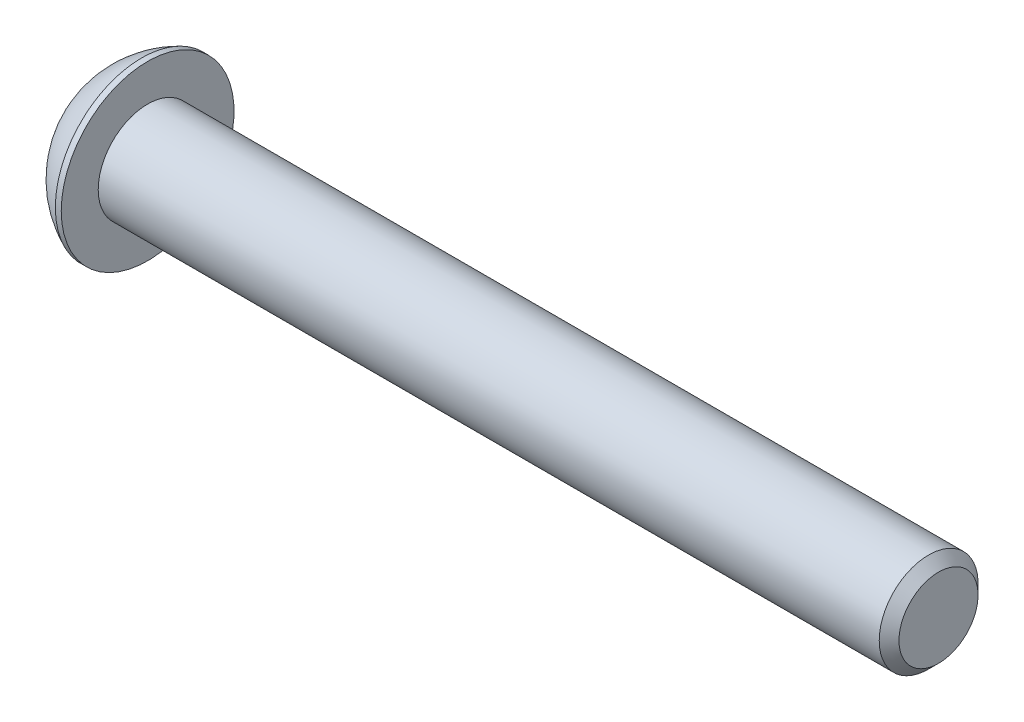
ISO-10303-21;
HEADER;
FILE_DESCRIPTION(('STEP AP214'),'2;1');
FILE_NAME('part.step','',(''),(''),'','','');
FILE_SCHEMA(('AUTOMOTIVE_DESIGN { 1 0 10303 214 1 1 1 1 }'));
ENDSEC;
DATA;
#1=APPLICATION_CONTEXT('core data for automotive mechanical design processes');
#2=APPLICATION_PROTOCOL_DEFINITION('international standard','automotive_design',2000,#1);
#3=PRODUCT_CONTEXT('',#1,'mechanical');
#4=PRODUCT('Part','Part','',(#3));
#5=PRODUCT_RELATED_PRODUCT_CATEGORY('part','',(#4));
#6=PRODUCT_DEFINITION_FORMATION('','',#4);
#7=PRODUCT_DEFINITION_CONTEXT('part definition',#1,'design');
#8=PRODUCT_DEFINITION('design','',#6,#7);
#9=PRODUCT_DEFINITION_SHAPE('','',#8);
#10=(LENGTH_UNIT() NAMED_UNIT(*) SI_UNIT(.MILLI.,.METRE.));
#11=(NAMED_UNIT(*) PLANE_ANGLE_UNIT() SI_UNIT($,.RADIAN.));
#12=(NAMED_UNIT(*) SI_UNIT($,.STERADIAN.) SOLID_ANGLE_UNIT());
#13=UNCERTAINTY_MEASURE_WITH_UNIT(LENGTH_MEASURE(1.E-05),#10,'distance_accuracy_value','');
#14=(GEOMETRIC_REPRESENTATION_CONTEXT(3) GLOBAL_UNCERTAINTY_ASSIGNED_CONTEXT((#13)) GLOBAL_UNIT_ASSIGNED_CONTEXT((#10,
#11,#12)) REPRESENTATION_CONTEXT('',''));
#15=CARTESIAN_POINT('',(0.,0.,0.));
#16=DIRECTION('',(0.,0.,1.));
#17=DIRECTION('',(1.,0.,0.));
#18=AXIS2_PLACEMENT_3D('',#15,#16,#17);
#19=CARTESIAN_POINT('',(1.32080000000034,0.,0.));
#20=DIRECTION('',(-1.,0.,0.));
#21=DIRECTION('',(0.,0.,1.));
#22=AXIS2_PLACEMENT_3D('',#19,#20,#21);
#23=CONICAL_SURFACE('',#22,1.1937999999998,1.04719755119608);
#24=CARTESIAN_POINT('',(2.01004075135902,0.,-4.44089209850063E-13));
#25=VERTEX_POINT('',#24);
#26=VERTEX_LOOP('',#25);
#27=FACE_BOUND('',#26,.T.);
#28=CARTESIAN_POINT('',(1.32080000000009,0.,0.));
#29=DIRECTION('',(-1.,0.,0.));
#30=DIRECTION('',(0.,0.,1.));
#31=AXIS2_PLACEMENT_3D('',#28,#29,#30);
#32=CIRCLE('',#31,1.19380000000024);
#33=CARTESIAN_POINT('',(1.32080000000009,0.,1.19380000000024));
#34=VERTEX_POINT('',#33);
#35=EDGE_CURVE('E20',#34,#34,#32,.T.);
#36=ORIENTED_EDGE('',*,*,#35,.T.);
#37=EDGE_LOOP('',(#36));
#38=FACE_BOUND('',#37,.T.);
#39=ADVANCED_FACE('F17',(#27,#38),#23,.F.);
#40=CARTESIAN_POINT('',(1.3208,-2.29135888084633,0.));
#41=DIRECTION('',(1.,0.,0.));
#42=DIRECTION('',(0.,0.,-1.));
#43=AXIS2_PLACEMENT_3D('',#40,#41,#42);
#44=PLANE('',#43);
#45=DIRECTION('',(0.,1.,0.));
#46=VECTOR('',#45,1.);
#47=CARTESIAN_POINT('',(1.3208,-1.14567944042316,1.984375));
#48=LINE('',#47,#46);
#49=CARTESIAN_POINT('',(1.3208,1.14567944042316,1.984375));
#50=VERTEX_POINT('',#49);
#51=CARTESIAN_POINT('',(1.3208,-1.14567944042316,1.984375));
#52=VERTEX_POINT('',#51);
#53=EDGE_CURVE('E69',#50,#52,#48,.F.);
#54=ORIENTED_EDGE('',*,*,#53,.F.);
#55=DIRECTION('',(0.,0.5,-0.866025403784439));
#56=VECTOR('',#55,1.);
#57=CARTESIAN_POINT('',(1.3208,1.14567944042316,1.984375));
#58=LINE('',#57,#56);
#59=CARTESIAN_POINT('',(1.3208,2.29135888084633,0.));
#60=VERTEX_POINT('',#59);
#61=EDGE_CURVE('E292',#60,#50,#58,.F.);
#62=ORIENTED_EDGE('',*,*,#61,.F.);
#63=DIRECTION('',(0.,-0.5,-0.866025403784439));
#64=VECTOR('',#63,1.);
#65=CARTESIAN_POINT('',(1.3208,2.29135888084633,0.));
#66=LINE('',#65,#64);
#67=CARTESIAN_POINT('',(1.3208,1.14567944042316,-1.984375));
#68=VERTEX_POINT('',#67);
#69=EDGE_CURVE('E296',#68,#60,#66,.F.);
#70=ORIENTED_EDGE('',*,*,#69,.F.);
#71=DIRECTION('',(0.,1.,0.));
#72=VECTOR('',#71,1.);
#73=CARTESIAN_POINT('',(1.3208,1.14567944042316,-1.984375));
#74=LINE('',#73,#72);
#75=CARTESIAN_POINT('',(1.3208,-1.14567944042316,-1.984375));
#76=VERTEX_POINT('',#75);
#77=EDGE_CURVE('E301',#76,#68,#74,.T.);
#78=ORIENTED_EDGE('',*,*,#77,.F.);
#79=DIRECTION('',(0.,-0.500000000000001,0.866025403784438));
#80=VECTOR('',#79,1.);
#81=CARTESIAN_POINT('',(1.3208,-1.14567944042316,-1.984375));
#82=LINE('',#81,#80);
#83=CARTESIAN_POINT('',(1.3208,-2.29135888084633,0.));
#84=VERTEX_POINT('',#83);
#85=EDGE_CURVE('E306',#84,#76,#82,.F.);
#86=ORIENTED_EDGE('',*,*,#85,.F.);
#87=DIRECTION('',(0.,0.500000000000001,0.866025403784438));
#88=VECTOR('',#87,1.);
#89=CARTESIAN_POINT('',(1.3208,-2.29135888084633,0.));
#90=LINE('',#89,#88);
#91=EDGE_CURVE('E82',#52,#84,#90,.F.);
#92=ORIENTED_EDGE('',*,*,#91,.F.);
#93=EDGE_LOOP('',(#54,#62,#70,#78,#86,#92));
#94=FACE_BOUND('',#93,.T.);
#95=ORIENTED_EDGE('',*,*,#35,.F.);
#96=EDGE_LOOP('',(#95));
#97=FACE_BOUND('',#96,.T.);
#98=ADVANCED_FACE('F75',(#94,#97),#44,.F.);
#99=CARTESIAN_POINT('',(1.3208,-1.14567944042316,1.984375));
#100=DIRECTION('',(0.,0.,-1.));
#101=DIRECTION('',(0.,1.,0.));
#102=AXIS2_PLACEMENT_3D('',#99,#100,#101);
#103=PLANE('',#102);
#104=ORIENTED_EDGE('',*,*,#53,.T.);
#105=DIRECTION('',(1.,0.,0.));
#106=VECTOR('',#105,1.);
#107=CARTESIAN_POINT('',(1.3208,-1.14567944042316,1.984375));
#108=LINE('',#107,#106);
#109=CARTESIAN_POINT('',(0.,-1.14567944042316,1.984375));
#110=VERTEX_POINT('',#109);
#111=EDGE_CURVE('E79',#110,#52,#108,.T.);
#112=ORIENTED_EDGE('',*,*,#111,.F.);
#113=DIRECTION('',(0.,1.,0.));
#114=VECTOR('',#113,1.);
#115=CARTESIAN_POINT('',(0.,0.,1.984375));
#116=LINE('',#115,#114);
#117=CARTESIAN_POINT('',(0.,1.14567944042316,1.984375));
#118=VERTEX_POINT('',#117);
#119=EDGE_CURVE('E286',#118,#110,#116,.F.);
#120=ORIENTED_EDGE('',*,*,#119,.F.);
#121=DIRECTION('',(1.,0.,0.));
#122=VECTOR('',#121,1.);
#123=CARTESIAN_POINT('',(1.3208,1.14567944042316,1.984375));
#124=LINE('',#123,#122);
#125=EDGE_CURVE('E289',#50,#118,#124,.F.);
#126=ORIENTED_EDGE('',*,*,#125,.F.);
#127=EDGE_LOOP('',(#104,#112,#120,#126));
#128=FACE_BOUND('',#127,.T.);
#129=ADVANCED_FACE('F128',(#128),#103,.T.);
#130=CARTESIAN_POINT('',(1.3208,-2.29135888084633,0.));
#131=DIRECTION('',(0.,0.866025403784438,-0.500000000000001));
#132=DIRECTION('',(0.,0.500000000000001,0.866025403784438));
#133=AXIS2_PLACEMENT_3D('',#130,#131,#132);
#134=PLANE('',#133);
#135=ORIENTED_EDGE('',*,*,#91,.T.);
#136=DIRECTION('',(1.,0.,0.));
#137=VECTOR('',#136,1.);
#138=CARTESIAN_POINT('',(1.3208,-2.29135888084633,0.));
#139=LINE('',#138,#137);
#140=CARTESIAN_POINT('',(0.,-2.29135888084633,0.));
#141=VERTEX_POINT('',#140);
#142=EDGE_CURVE('E308',#141,#84,#139,.T.);
#143=ORIENTED_EDGE('',*,*,#142,.F.);
#144=DIRECTION('',(0.,-0.500000000000001,-0.866025403784438));
#145=VECTOR('',#144,1.);
#146=CARTESIAN_POINT('',(0.,-1.14567944042316,1.984375));
#147=LINE('',#146,#145);
#148=EDGE_CURVE('E283',#110,#141,#147,.T.);
#149=ORIENTED_EDGE('',*,*,#148,.F.);
#150=ORIENTED_EDGE('',*,*,#111,.T.);
#151=EDGE_LOOP('',(#135,#143,#149,#150));
#152=FACE_BOUND('',#151,.T.);
#153=ADVANCED_FACE('F124',(#152),#134,.T.);
#154=CARTESIAN_POINT('',(1.3208,-1.14567944042316,-1.984375));
#155=DIRECTION('',(0.,0.866025403784438,0.500000000000001));
#156=DIRECTION('',(0.,-0.500000000000001,0.866025403784438));
#157=AXIS2_PLACEMENT_3D('',#154,#155,#156);
#158=PLANE('',#157);
#159=ORIENTED_EDGE('',*,*,#85,.T.);
#160=DIRECTION('',(1.,0.,0.));
#161=VECTOR('',#160,1.);
#162=CARTESIAN_POINT('',(1.3208,-1.14567944042316,-1.984375));
#163=LINE('',#162,#161);
#164=CARTESIAN_POINT('',(0.,-1.14567944042316,-1.984375));
#165=VERTEX_POINT('',#164);
#166=EDGE_CURVE('E303',#165,#76,#163,.T.);
#167=ORIENTED_EDGE('',*,*,#166,.F.);
#168=DIRECTION('',(0.,0.500000000000001,-0.866025403784438));
#169=VECTOR('',#168,1.);
#170=CARTESIAN_POINT('',(0.,-2.29135888084633,0.));
#171=LINE('',#170,#169);
#172=EDGE_CURVE('E280',#141,#165,#171,.T.);
#173=ORIENTED_EDGE('',*,*,#172,.F.);
#174=ORIENTED_EDGE('',*,*,#142,.T.);
#175=EDGE_LOOP('',(#159,#167,#173,#174));
#176=FACE_BOUND('',#175,.T.);
#177=ADVANCED_FACE('F120',(#176),#158,.T.);
#178=CARTESIAN_POINT('',(1.3208,1.14567944042316,-1.984375));
#179=DIRECTION('',(0.,0.,1.));
#180=DIRECTION('',(1.,0.,0.));
#181=AXIS2_PLACEMENT_3D('',#178,#179,#180);
#182=PLANE('',#181);
#183=ORIENTED_EDGE('',*,*,#77,.T.);
#184=DIRECTION('',(1.,0.,0.));
#185=VECTOR('',#184,1.);
#186=CARTESIAN_POINT('',(1.3208,1.14567944042316,-1.984375));
#187=LINE('',#186,#185);
#188=CARTESIAN_POINT('',(0.,1.14567944042316,-1.984375));
#189=VERTEX_POINT('',#188);
#190=EDGE_CURVE('E298',#189,#68,#187,.T.);
#191=ORIENTED_EDGE('',*,*,#190,.F.);
#192=DIRECTION('',(0.,1.,0.));
#193=VECTOR('',#192,1.);
#194=CARTESIAN_POINT('',(0.,0.,-1.984375));
#195=LINE('',#194,#193);
#196=EDGE_CURVE('E277',#165,#189,#195,.T.);
#197=ORIENTED_EDGE('',*,*,#196,.F.);
#198=ORIENTED_EDGE('',*,*,#166,.T.);
#199=EDGE_LOOP('',(#183,#191,#197,#198));
#200=FACE_BOUND('',#199,.T.);
#201=ADVANCED_FACE('F117',(#200),#182,.T.);
#202=CARTESIAN_POINT('',(1.3208,2.29135888084633,0.));
#203=DIRECTION('',(0.,-0.866025403784439,0.5));
#204=DIRECTION('',(0.,-0.5,-0.866025403784439));
#205=AXIS2_PLACEMENT_3D('',#202,#203,#204);
#206=PLANE('',#205);
#207=ORIENTED_EDGE('',*,*,#69,.T.);
#208=DIRECTION('',(1.,0.,0.));
#209=VECTOR('',#208,1.);
#210=CARTESIAN_POINT('',(1.3208,2.29135888084633,0.));
#211=LINE('',#210,#209);
#212=CARTESIAN_POINT('',(0.,2.29135888084633,0.));
#213=VERTEX_POINT('',#212);
#214=EDGE_CURVE('E35',#213,#60,#211,.T.);
#215=ORIENTED_EDGE('',*,*,#214,.F.);
#216=DIRECTION('',(0.,0.5,0.866025403784439));
#217=VECTOR('',#216,1.);
#218=CARTESIAN_POINT('',(0.,1.14567944042316,-1.984375));
#219=LINE('',#218,#217);
#220=EDGE_CURVE('E274',#189,#213,#219,.T.);
#221=ORIENTED_EDGE('',*,*,#220,.F.);
#222=ORIENTED_EDGE('',*,*,#190,.T.);
#223=EDGE_LOOP('',(#207,#215,#221,#222));
#224=FACE_BOUND('',#223,.T.);
#225=ADVANCED_FACE('F113',(#224),#206,.T.);
#226=CARTESIAN_POINT('',(1.3208,1.14567944042316,1.984375));
#227=DIRECTION('',(0.,-0.866025403784439,-0.5));
#228=DIRECTION('',(0.,0.5,-0.866025403784439));
#229=AXIS2_PLACEMENT_3D('',#226,#227,#228);
#230=PLANE('',#229);
#231=ORIENTED_EDGE('',*,*,#61,.T.);
#232=ORIENTED_EDGE('',*,*,#125,.T.);
#233=DIRECTION('',(0.,-0.5,0.866025403784438));
#234=VECTOR('',#233,1.);
#235=CARTESIAN_POINT('',(0.,2.29135888084633,0.));
#236=LINE('',#235,#234);
#237=EDGE_CURVE('E100',#213,#118,#236,.T.);
#238=ORIENTED_EDGE('',*,*,#237,.F.);
#239=ORIENTED_EDGE('',*,*,#214,.T.);
#240=EDGE_LOOP('',(#231,#232,#238,#239));
#241=FACE_BOUND('',#240,.T.);
#242=ADVANCED_FACE('F109',(#241),#230,.T.);
#243=CARTESIAN_POINT('',(0.,0.,0.));
#244=DIRECTION('',(-1.,0.,0.));
#245=DIRECTION('',(0.,0.,1.));
#246=AXIS2_PLACEMENT_3D('',#243,#244,#245);
#247=PLANE('',#246);
#248=ORIENTED_EDGE('',*,*,#220,.T.);
#249=ORIENTED_EDGE('',*,*,#237,.T.);
#250=ORIENTED_EDGE('',*,*,#119,.T.);
#251=ORIENTED_EDGE('',*,*,#148,.T.);
#252=ORIENTED_EDGE('',*,*,#172,.T.);
#253=ORIENTED_EDGE('',*,*,#196,.T.);
#254=EDGE_LOOP('',(#248,#249,#250,#251,#252,#253));
#255=FACE_BOUND('',#254,.T.);
#256=CARTESIAN_POINT('',(0.,2.77495,0.));
#257=CARTESIAN_POINT('',(0.,2.77494953309947,0.0779118937523459));
#258=CARTESIAN_POINT('',(0.,2.77166578388025,0.15583810591977));
#259=CARTESIAN_POINT('',(0.,2.75855213600204,0.311152012455904));
#260=CARTESIAN_POINT('',(0.,2.74872030471467,0.388539541019556));
#261=CARTESIAN_POINT('',(0.,2.72255472645676,0.542341518735717));
#262=CARTESIAN_POINT('',(-2.70414110576258E-13,2.70621065843663,0.618754223567578));
#263=CARTESIAN_POINT('',(2.71501725221868E-13,2.66713326915777,0.769973634286023));
#264=CARTESIAN_POINT('',(1.01274952524446E-12,2.64439476297869,0.844778983646282));
#265=CARTESIAN_POINT('',(1.81909959813207E-12,2.56690195943351,1.06566239301792));
#266=CARTESIAN_POINT('',(4.77081687541822E-13,2.50280672569928,1.20857954243987));
#267=CARTESIAN_POINT('',(-4.76232447128612E-13,2.35149826934097,1.48160874561538));
#268=CARTESIAN_POINT('',(0.,2.26428416790397,1.61172031233499));
#269=CARTESIAN_POINT('',(0.,2.1181093928834,1.79445660654268));
#270=CARTESIAN_POINT('',(0.,2.06678693791626,1.85333128513996));
#271=CARTESIAN_POINT('',(0.,1.95940522984449,1.96650727912792));
#272=CARTESIAN_POINT('',(0.,1.90335059143535,2.02081294920044));
#273=CARTESIAN_POINT('',(0.,1.78683891013963,2.12453280878582));
#274=CARTESIAN_POINT('',(0.,1.72637988450322,2.1739447713554));
#275=CARTESIAN_POINT('',(0.,1.60151968865711,2.26750481692908));
#276=CARTESIAN_POINT('',(0.,1.53711760864537,2.31165167810847));
#277=CARTESIAN_POINT('',(0.,1.33869902291632,2.43567242603944));
#278=CARTESIAN_POINT('',(0.,1.19934704110695,2.507235886628));
#279=CARTESIAN_POINT('',(0.,0.910681609121881,2.62590828672821));
#280=CARTESIAN_POINT('',(0.,0.761368265357398,2.67301748742278));
#281=CARTESIAN_POINT('',(0.,0.456932649466623,2.74151230664007));
#282=CARTESIAN_POINT('',(0.,0.301810346322584,2.76289778778721));
#283=CARTESIAN_POINT('',(0.,-0.00982263870895171,2.77931595661156));
#284=CARTESIAN_POINT('',(0.,-0.166333320596448,2.77434864428877));
#285=CARTESIAN_POINT('',(0.,-0.476280836814452,2.73822217653073));
#286=CARTESIAN_POINT('',(0.,-0.629717687555985,2.70706316096981));
#287=CARTESIAN_POINT('',(0.,-0.929254830044274,2.61937980771149));
#288=CARTESIAN_POINT('',(0.,-1.0753550434132,2.56285519909568));
#289=CARTESIAN_POINT('',(0.,-1.28570692598579,2.46037024128109));
#290=CARTESIAN_POINT('',(0.,-1.35439130022287,2.42323494812896));
#291=CARTESIAN_POINT('',(0.,-1.488391287199,2.34331277270256));
#292=CARTESIAN_POINT('',(0.,-1.55370767631787,2.30052720108831));
#293=CARTESIAN_POINT('',(0.,-1.68047292776594,2.20962421887055));
#294=CARTESIAN_POINT('',(0.,-1.7419235278682,2.16150923122348));
#295=CARTESIAN_POINT('',(0.,-1.86060297067992,2.06024311301283));
#296=CARTESIAN_POINT('',(0.,-1.91782768181715,2.0070871669763));
#297=CARTESIAN_POINT('',(0.,-2.08239462196651,1.8407220856554));
#298=CARTESIAN_POINT('',(0.,-2.18279764272601,1.72049499758422));
#299=CARTESIAN_POINT('',(0.,-2.36195754944063,1.46487629213018));
#300=CARTESIAN_POINT('',(0.,-2.44071525816758,1.32948525142807));
#301=CARTESIAN_POINT('',(0.,-2.54098882695274,1.11796734074395));
#302=CARTESIAN_POINT('',(0.,-2.57146177392727,1.04596540008347));
#303=CARTESIAN_POINT('',(0.,-2.62621251108999,0.899689259475764));
#304=CARTESIAN_POINT('',(0.,-2.65049531495563,0.825416953360952));
#305=CARTESIAN_POINT('',(0.,-2.69267708798766,0.675215808695207));
#306=CARTESIAN_POINT('',(0.,-2.71058613777937,0.599289789313092));
#307=CARTESIAN_POINT('',(0.,-2.73994710360127,0.446213628496932));
#308=CARTESIAN_POINT('',(0.,-2.75140092413871,0.369063855024788));
#309=CARTESIAN_POINT('',(0.,-2.76470470685522,0.24316208817343));
#310=CARTESIAN_POINT('',(0.,-2.76854547596618,0.194611672428577));
#311=CARTESIAN_POINT('',(0.,-2.77366826843264,0.0973760351839812));
#312=CARTESIAN_POINT('',(0.,-2.77495029178814,0.0486908136842395));
#313=CARTESIAN_POINT('',(0.,-2.77494953309947,-0.0779118937523475));
#314=CARTESIAN_POINT('',(0.,-2.77166578388025,-0.155838105919772));
#315=CARTESIAN_POINT('',(0.,-2.75855213600204,-0.311152012455906));
#316=CARTESIAN_POINT('',(0.,-2.74872030471467,-0.388539541019558));
#317=CARTESIAN_POINT('',(0.,-2.72255472645677,-0.542341518735719));
#318=CARTESIAN_POINT('',(-2.70149297926331E-13,-2.70621065843663,-0.61875422356758));
#319=CARTESIAN_POINT('',(2.712366972268E-13,-2.66713326915777,-0.769973634286024));
#320=CARTESIAN_POINT('',(1.0114146773846E-12,-2.64439476297869,-0.844778983646283));
#321=CARTESIAN_POINT('',(1.81656702958366E-12,-2.5669019594335,-1.06566239301792));
#322=CARTESIAN_POINT('',(4.7641829195856E-13,-2.50280672569928,-1.20857954243988));
#323=CARTESIAN_POINT('',(-4.75569026324205E-13,-2.35149826934097,-1.48160874561538));
#324=CARTESIAN_POINT('',(0.,-2.26428416790396,-1.61172031233499));
#325=CARTESIAN_POINT('',(0.,-2.1181093928834,-1.79445660654268));
#326=CARTESIAN_POINT('',(0.,-2.06678693791626,-1.85333128513997));
#327=CARTESIAN_POINT('',(0.,-1.95940522984449,-1.96650727912792));
#328=CARTESIAN_POINT('',(0.,-1.90335059143535,-2.02081294920044));
#329=CARTESIAN_POINT('',(0.,-1.78683891013963,-2.12453280878582));
#330=CARTESIAN_POINT('',(0.,-1.72637988450322,-2.1739447713554));
#331=CARTESIAN_POINT('',(0.,-1.60151968865711,-2.26750481692908));
#332=CARTESIAN_POINT('',(0.,-1.53711760864537,-2.31165167810847));
#333=CARTESIAN_POINT('',(0.,-1.33869902291632,-2.43567242603944));
#334=CARTESIAN_POINT('',(0.,-1.19934704110695,-2.507235886628));
#335=CARTESIAN_POINT('',(0.,-0.91068160912188,-2.62590828672821));
#336=CARTESIAN_POINT('',(0.,-0.761368265357396,-2.67301748742278));
#337=CARTESIAN_POINT('',(0.,-0.456932649466621,-2.74151230664007));
#338=CARTESIAN_POINT('',(0.,-0.301810346322582,-2.76289778778721));
#339=CARTESIAN_POINT('',(0.,0.00982263870895353,-2.77931595661156));
#340=CARTESIAN_POINT('',(0.,0.16633332059645,-2.77434864428876));
#341=CARTESIAN_POINT('',(0.,0.476280836814454,-2.73822217653073));
#342=CARTESIAN_POINT('',(0.,0.629717687555987,-2.70706316096981));
#343=CARTESIAN_POINT('',(0.,0.929254830044276,-2.6193798077115));
#344=CARTESIAN_POINT('',(0.,1.0753550434132,-2.56285519909568));
#345=CARTESIAN_POINT('',(0.,1.28570692598579,-2.46037024128109));
#346=CARTESIAN_POINT('',(0.,1.35439130022287,-2.42323494812896));
#347=CARTESIAN_POINT('',(0.,1.488391287199,-2.34331277270256));
#348=CARTESIAN_POINT('',(0.,1.55370767631787,-2.30052720108831));
#349=CARTESIAN_POINT('',(0.,1.68047292776594,-2.20962421887055));
#350=CARTESIAN_POINT('',(0.,1.7419235278682,-2.16150923122348));
#351=CARTESIAN_POINT('',(0.,1.86060297067992,-2.06024311301282));
#352=CARTESIAN_POINT('',(0.,1.91782768181716,-2.0070871669763));
#353=CARTESIAN_POINT('',(0.,2.08239462196651,-1.8407220856554));
#354=CARTESIAN_POINT('',(0.,2.18279764272601,-1.72049499758422));
#355=CARTESIAN_POINT('',(0.,2.36195754944063,-1.46487629213018));
#356=CARTESIAN_POINT('',(0.,2.44071525816757,-1.32948525142807));
#357=CARTESIAN_POINT('',(0.,2.54098882695273,-1.11796734074395));
#358=CARTESIAN_POINT('',(0.,2.57146177392727,-1.04596540008347));
#359=CARTESIAN_POINT('',(0.,2.62621251108999,-0.899689259475765));
#360=CARTESIAN_POINT('',(0.,2.65049531495563,-0.825416953360953));
#361=CARTESIAN_POINT('',(0.,2.69267708798766,-0.675215808695207));
#362=CARTESIAN_POINT('',(0.,2.71058613777936,-0.599289789313092));
#363=CARTESIAN_POINT('',(0.,2.73994710360127,-0.446213628496932));
#364=CARTESIAN_POINT('',(0.,2.75140092413871,-0.369063855024789));
#365=CARTESIAN_POINT('',(0.,2.76470470685522,-0.243162088173432));
#366=CARTESIAN_POINT('',(0.,2.76854547596618,-0.194611672428578));
#367=CARTESIAN_POINT('',(0.,2.77366826843264,-0.0973760351839823));
#368=CARTESIAN_POINT('',(0.,2.77495029178814,-0.0486908136842408));
#369=CARTESIAN_POINT('',(0.,2.77495,0.));
#370=B_SPLINE_CURVE_WITH_KNOTS('',3,(#256,#257,#258,#259,#260,#261,#262,#263,#264,#265,#266,
#267,#268,#269,#270,#271,#272,#273,#274,#275,#276,#277,#278,#279,#280,#281,#282,#283,#284,#285,
#286,#287,#288,#289,#290,#291,#292,#293,#294,#295,#296,#297,#298,#299,#300,#301,#302,#303,#304,
#305,#306,#307,#308,#309,#310,#311,#312,#313,#314,#315,#316,#317,#318,#319,#320,#321,#322,#323,
#324,#325,#326,#327,#328,#329,#330,#331,#332,#333,#334,#335,#336,#337,#338,#339,#340,#341,#342,
#343,#344,#345,#346,#347,#348,#349,#350,#351,#352,#353,#354,#355,#356,#357,#358,#359,#360,#361,
#362,#363,#364,#365,#366,#367,#368,#369),.UNSPECIFIED.,.T.,.F.,(4,2,2,2,2,2,2,2,2,2,2,2,2,2,2,2,
2,2,2,2,2,2,2,2,2,2,2,2,2,2,2,2,2,2,2,2,2,2,2,2,2,2,2,2,2,2,2,2,2,2,2,2,2,2,2,2,4),(0.,
0.233690856748162,0.467450716578751,0.701582538521471,0.935904756015414,1.40343220467667,
1.87097742791502,2.10505636898837,2.33890962270652,2.57286880998746,2.80688218486306,
3.27442101763127,3.74195485676357,4.20949119271389,4.67702752866417,5.14456136779641,
5.61210020056468,5.84611357544033,6.08007276272136,6.31392601643949,6.54800495751273,
7.01555018075072,7.48307762941212,7.71739984690652,7.95153166884955,8.18529152868023,
8.41898238542855,8.56502681353347,8.71107124163843,8.94476209838659,9.17852195821718,
9.4126537801599,9.64697599765384,10.1145034463151,10.5820486695534,10.8161276106268,
11.0499808643449,11.2839400516259,11.5179534265015,11.9854922592697,12.453026098402,
12.9205624343523,13.3880987703026,13.8556326094348,14.3231714422031,14.5571848170788,
14.7911440043598,15.0249972580779,15.2590761991512,15.7266214223891,16.1941488710506,
16.4284710885449,16.662602910488,16.8963627703186,17.130053627067,17.2760980551719,
17.4221424832769),.UNSPECIFIED.);
#371=CARTESIAN_POINT('',(0.,2.77495,0.));
#372=VERTEX_POINT('',#371);
#373=EDGE_CURVE('E94',#372,#372,#370,.T.);
#374=ORIENTED_EDGE('',*,*,#373,.F.);
#375=EDGE_LOOP('',(#374));
#376=FACE_BOUND('',#375,.T.);
#377=ADVANCED_FACE('F105',(#255,#376),#247,.T.);
#378=CARTESIAN_POINT('',(5.37260881410256,0.,0.));
#379=DIRECTION('',(0.,1.,0.));
#380=DIRECTION('',(1.,0.,0.));
#381=AXIS2_PLACEMENT_3D('',#378,#379,#380);
#382=SPHERICAL_SURFACE('',#381,6.04692260342999);
#383=CARTESIAN_POINT('',(2.9718,0.,0.));
#384=DIRECTION('',(-1.,0.,0.));
#385=DIRECTION('',(0.,0.,1.));
#386=AXIS2_PLACEMENT_3D('',#383,#384,#385);
#387=CIRCLE('',#386,5.5499);
#388=CARTESIAN_POINT('',(2.9718,0.,5.5499));
#389=VERTEX_POINT('',#388);
#390=EDGE_CURVE('E92',#389,#389,#387,.F.);
#391=ORIENTED_EDGE('',*,*,#390,.F.);
#392=EDGE_LOOP('',(#391));
#393=FACE_BOUND('',#392,.T.);
#394=ORIENTED_EDGE('',*,*,#373,.T.);
#395=EDGE_LOOP('',(#394));
#396=FACE_BOUND('',#395,.T.);
#397=ADVANCED_FACE('F101',(#393,#396),#382,.T.);
#398=CARTESIAN_POINT('',(54.1528,0.,0.));
#399=DIRECTION('',(-1.,0.,0.));
#400=DIRECTION('',(0.,0.,1.));
#401=AXIS2_PLACEMENT_3D('',#398,#399,#400);
#402=PLANE('',#401);
#403=CARTESIAN_POINT('',(54.152800000054,0.,0.));
#404=DIRECTION('',(-1.,0.,0.));
#405=DIRECTION('',(0.,0.,1.));
#406=AXIS2_PLACEMENT_3D('',#403,#404,#405);
#407=CIRCLE('',#406,2.53999999995358);
#408=CARTESIAN_POINT('',(54.152800000054,0.,2.53999999995358));
#409=VERTEX_POINT('',#408);
#410=EDGE_CURVE('E89',#409,#409,#407,.T.);
#411=ORIENTED_EDGE('',*,*,#410,.F.);
#412=EDGE_LOOP('',(#411));
#413=FACE_BOUND('',#412,.T.);
#414=ADVANCED_FACE('F154',(#413),#402,.F.);
#415=CARTESIAN_POINT('',(0.,0.,0.));
#416=DIRECTION('',(-1.,0.,0.));
#417=DIRECTION('',(0.,0.,1.));
#418=AXIS2_PLACEMENT_3D('',#415,#416,#417);
#419=CYLINDRICAL_SURFACE('',#418,5.5499);
#420=ORIENTED_EDGE('',*,*,#390,.T.);
#421=EDGE_LOOP('',(#420));
#422=FACE_BOUND('',#421,.T.);
#423=CARTESIAN_POINT('',(3.3528,0.,0.));
#424=DIRECTION('',(-1.,0.,0.));
#425=DIRECTION('',(0.,0.,1.));
#426=AXIS2_PLACEMENT_3D('',#423,#424,#425);
#427=CIRCLE('',#426,5.5499);
#428=CARTESIAN_POINT('',(3.3528,0.,5.5499));
#429=VERTEX_POINT('',#428);
#430=EDGE_CURVE('E86',#429,#429,#427,.T.);
#431=ORIENTED_EDGE('',*,*,#430,.T.);
#432=EDGE_LOOP('',(#431));
#433=FACE_BOUND('',#432,.T.);
#434=ADVANCED_FACE('F151',(#422,#433),#419,.T.);
#435=CARTESIAN_POINT('',(53.5178000000656,0.,0.));
#436=DIRECTION('',(-1.,0.,0.));
#437=DIRECTION('',(0.,0.,1.));
#438=AXIS2_PLACEMENT_3D('',#435,#436,#437);
#439=CONICAL_SURFACE('',#438,3.17499999994197,0.785398163397448);
#440=CARTESIAN_POINT('',(53.5178,0.,0.));
#441=DIRECTION('',(-1.,0.,0.));
#442=DIRECTION('',(0.,0.,1.));
#443=AXIS2_PLACEMENT_3D('',#440,#441,#442);
#444=CIRCLE('',#443,3.175);
#445=CARTESIAN_POINT('',(53.5178,0.,3.175));
#446=VERTEX_POINT('',#445);
#447=EDGE_CURVE('E26',#446,#446,#444,.T.);
#448=ORIENTED_EDGE('',*,*,#447,.F.);
#449=EDGE_LOOP('',(#448));
#450=FACE_BOUND('',#449,.T.);
#451=ORIENTED_EDGE('',*,*,#410,.T.);
#452=EDGE_LOOP('',(#451));
#453=FACE_BOUND('',#452,.T.);
#454=ADVANCED_FACE('F144',(#450,#453),#439,.T.);
#455=CARTESIAN_POINT('',(3.3528,3.175,0.));
#456=DIRECTION('',(-1.,0.,0.));
#457=DIRECTION('',(0.,0.,1.));
#458=AXIS2_PLACEMENT_3D('',#455,#456,#457);
#459=PLANE('',#458);
#460=CARTESIAN_POINT('',(3.3528,0.,0.));
#461=DIRECTION('',(-1.,0.,0.));
#462=DIRECTION('',(0.,0.,1.));
#463=AXIS2_PLACEMENT_3D('',#460,#461,#462);
#464=CIRCLE('',#463,3.175);
#465=CARTESIAN_POINT('',(3.3528,0.,3.175));
#466=VERTEX_POINT('',#465);
#467=EDGE_CURVE('E11',#466,#466,#464,.F.);
#468=ORIENTED_EDGE('',*,*,#467,.F.);
#469=EDGE_LOOP('',(#468));
#470=FACE_BOUND('',#469,.T.);
#471=ORIENTED_EDGE('',*,*,#430,.F.);
#472=EDGE_LOOP('',(#471));
#473=FACE_BOUND('',#472,.T.);
#474=ADVANCED_FACE('F138',(#470,#473),#459,.F.);
#475=CARTESIAN_POINT('',(0.,0.,0.));
#476=DIRECTION('',(-1.,0.,0.));
#477=DIRECTION('',(0.,0.,1.));
#478=AXIS2_PLACEMENT_3D('',#475,#476,#477);
#479=CYLINDRICAL_SURFACE('',#478,3.175);
#480=ORIENTED_EDGE('',*,*,#467,.T.);
#481=EDGE_LOOP('',(#480));
#482=FACE_BOUND('',#481,.T.);
#483=ORIENTED_EDGE('',*,*,#447,.T.);
#484=EDGE_LOOP('',(#483));
#485=FACE_BOUND('',#484,.T.);
#486=ADVANCED_FACE('F136',(#482,#485),#479,.T.);
#487=CLOSED_SHELL('',(#39,#98,#129,#153,#177,#201,#225,#242,#377,#397,#414,#434,#454,#474,#486));
#488=MANIFOLD_SOLID_BREP('B1',#487);
#489=ADVANCED_BREP_SHAPE_REPRESENTATION('',(#18,#488),#14);
#490=SHAPE_DEFINITION_REPRESENTATION(#9,#489);
ENDSEC;
END-ISO-10303-21;
